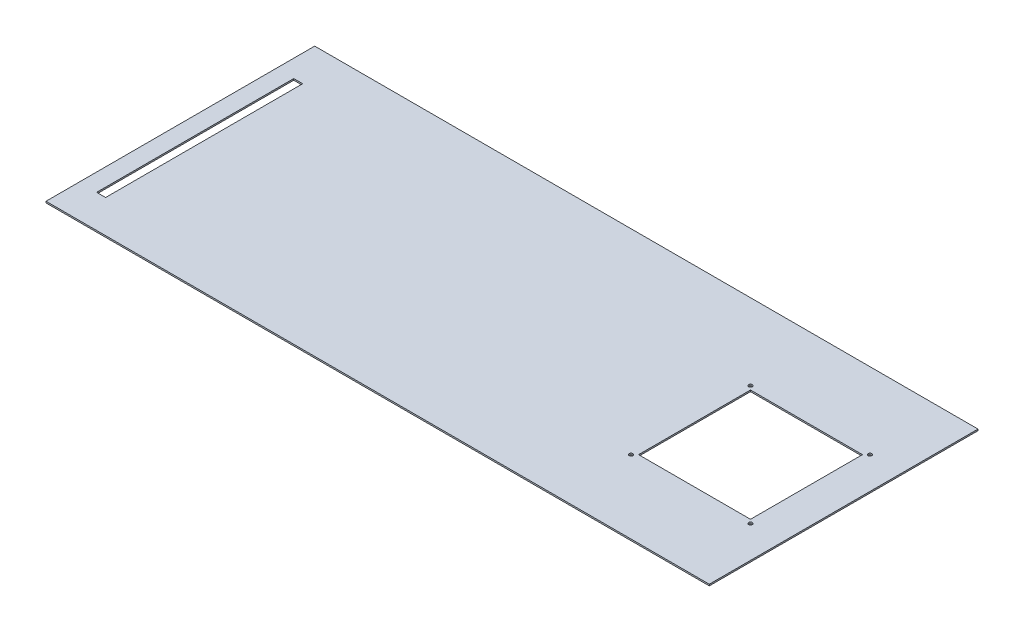
ISO-10303-21;
HEADER;
FILE_DESCRIPTION(('STEP AP214'),'2;1');
FILE_NAME('part.step','',(''),(''),'','','');
FILE_SCHEMA(('AUTOMOTIVE_DESIGN { 1 0 10303 214 1 1 1 1 }'));
ENDSEC;
DATA;
#1=APPLICATION_CONTEXT('core data for automotive mechanical design processes');
#2=APPLICATION_PROTOCOL_DEFINITION('international standard','automotive_design',2000,#1);
#3=PRODUCT_CONTEXT('',#1,'mechanical');
#4=PRODUCT('Part','Part','',(#3));
#5=PRODUCT_RELATED_PRODUCT_CATEGORY('part','',(#4));
#6=PRODUCT_DEFINITION_FORMATION('','',#4);
#7=PRODUCT_DEFINITION_CONTEXT('part definition',#1,'design');
#8=PRODUCT_DEFINITION('design','',#6,#7);
#9=PRODUCT_DEFINITION_SHAPE('','',#8);
#10=(LENGTH_UNIT() NAMED_UNIT(*) SI_UNIT(.MILLI.,.METRE.));
#11=(NAMED_UNIT(*) PLANE_ANGLE_UNIT() SI_UNIT($,.RADIAN.));
#12=(NAMED_UNIT(*) SI_UNIT($,.STERADIAN.) SOLID_ANGLE_UNIT());
#13=UNCERTAINTY_MEASURE_WITH_UNIT(LENGTH_MEASURE(1.E-05),#10,'distance_accuracy_value','');
#14=(GEOMETRIC_REPRESENTATION_CONTEXT(3) GLOBAL_UNCERTAINTY_ASSIGNED_CONTEXT((#13)) GLOBAL_UNIT_ASSIGNED_CONTEXT((#10,
#11,#12)) REPRESENTATION_CONTEXT('',''));
#15=CARTESIAN_POINT('',(0.,0.,0.));
#16=DIRECTION('',(0.,0.,1.));
#17=DIRECTION('',(1.,0.,0.));
#18=AXIS2_PLACEMENT_3D('',#15,#16,#17);
#19=CARTESIAN_POINT('',(-462.917777777778,2.,-190.916666666667));
#20=DIRECTION('',(1.,0.,0.));
#21=DIRECTION('',(0.,0.,-1.));
#22=AXIS2_PLACEMENT_3D('',#19,#20,#21);
#23=PLANE('',#22);
#24=DIRECTION('',(0.,0.,1.));
#25=VECTOR('',#24,1.);
#26=CARTESIAN_POINT('',(-462.917777777778,0.,-190.916666666667));
#27=LINE('',#26,#25);
#28=CARTESIAN_POINT('',(-462.917777777778,0.,-190.916666666667));
#29=VERTEX_POINT('',#28);
#30=CARTESIAN_POINT('',(-462.917777777778,0.,169.083333333333));
#31=VERTEX_POINT('',#30);
#32=EDGE_CURVE('E168',#29,#31,#27,.T.);
#33=ORIENTED_EDGE('',*,*,#32,.T.);
#34=DIRECTION('',(0.,-1.,0.));
#35=VECTOR('',#34,1.);
#36=CARTESIAN_POINT('',(-462.917777777778,2.,169.083333333333));
#37=LINE('',#36,#35);
#38=CARTESIAN_POINT('',(-462.917777777778,2.,169.083333333333));
#39=VERTEX_POINT('',#38);
#40=EDGE_CURVE('E201',#39,#31,#37,.T.);
#41=ORIENTED_EDGE('',*,*,#40,.F.);
#42=DIRECTION('',(0.,0.,1.));
#43=VECTOR('',#42,1.);
#44=CARTESIAN_POINT('',(-462.917777777778,2.,-190.916666666667));
#45=LINE('',#44,#43);
#46=CARTESIAN_POINT('',(-462.917777777778,2.,-190.916666666667));
#47=VERTEX_POINT('',#46);
#48=EDGE_CURVE('E175',#47,#39,#45,.T.);
#49=ORIENTED_EDGE('',*,*,#48,.F.);
#50=DIRECTION('',(0.,-1.,0.));
#51=VECTOR('',#50,1.);
#52=CARTESIAN_POINT('',(-462.917777777778,2.,-190.916666666667));
#53=LINE('',#52,#51);
#54=EDGE_CURVE('E185',#47,#29,#53,.T.);
#55=ORIENTED_EDGE('',*,*,#54,.T.);
#56=EDGE_LOOP('',(#33,#41,#49,#55));
#57=FACE_BOUND('',#56,.T.);
#58=ADVANCED_FACE('F35',(#57),#23,.F.);
#59=CARTESIAN_POINT('',(-462.917777777778,2.,169.083333333333));
#60=DIRECTION('',(0.,0.,-1.));
#61=DIRECTION('',(-1.,0.,0.));
#62=AXIS2_PLACEMENT_3D('',#59,#60,#61);
#63=PLANE('',#62);
#64=DIRECTION('',(1.,0.,0.));
#65=VECTOR('',#64,1.);
#66=CARTESIAN_POINT('',(-462.917777777778,0.,169.083333333333));
#67=LINE('',#66,#65);
#68=CARTESIAN_POINT('',(425.722222222222,0.,169.083333333333));
#69=VERTEX_POINT('',#68);
#70=EDGE_CURVE('E188',#31,#69,#67,.T.);
#71=ORIENTED_EDGE('',*,*,#70,.T.);
#72=DIRECTION('',(0.,-1.,0.));
#73=VECTOR('',#72,1.);
#74=CARTESIAN_POINT('',(425.722222222222,2.,169.083333333333));
#75=LINE('',#74,#73);
#76=CARTESIAN_POINT('',(425.722222222222,2.,169.083333333333));
#77=VERTEX_POINT('',#76);
#78=EDGE_CURVE('E198',#77,#69,#75,.T.);
#79=ORIENTED_EDGE('',*,*,#78,.F.);
#80=DIRECTION('',(1.,0.,0.));
#81=VECTOR('',#80,1.);
#82=CARTESIAN_POINT('',(-462.917777777778,2.,169.083333333333));
#83=LINE('',#82,#81);
#84=EDGE_CURVE('E178',#39,#77,#83,.T.);
#85=ORIENTED_EDGE('',*,*,#84,.F.);
#86=ORIENTED_EDGE('',*,*,#40,.T.);
#87=EDGE_LOOP('',(#71,#79,#85,#86));
#88=FACE_BOUND('',#87,.T.);
#89=ADVANCED_FACE('F248',(#88),#63,.F.);
#90=CARTESIAN_POINT('',(425.722222222222,2.,-190.916666666667));
#91=DIRECTION('',(-1.,0.,0.));
#92=DIRECTION('',(0.,0.,1.));
#93=AXIS2_PLACEMENT_3D('',#90,#91,#92);
#94=PLANE('',#93);
#95=DIRECTION('',(0.,0.,-1.));
#96=VECTOR('',#95,1.);
#97=CARTESIAN_POINT('',(425.722222222222,0.,-190.916666666667));
#98=LINE('',#97,#96);
#99=CARTESIAN_POINT('',(425.722222222222,0.,-190.916666666667));
#100=VERTEX_POINT('',#99);
#101=EDGE_CURVE('E190',#69,#100,#98,.T.);
#102=ORIENTED_EDGE('',*,*,#101,.T.);
#103=DIRECTION('',(0.,-1.,0.));
#104=VECTOR('',#103,1.);
#105=CARTESIAN_POINT('',(425.722222222222,2.,-190.916666666667));
#106=LINE('',#105,#104);
#107=CARTESIAN_POINT('',(425.722222222222,2.,-190.916666666667));
#108=VERTEX_POINT('',#107);
#109=EDGE_CURVE('E195',#108,#100,#106,.T.);
#110=ORIENTED_EDGE('',*,*,#109,.F.);
#111=DIRECTION('',(0.,0.,-1.));
#112=VECTOR('',#111,1.);
#113=CARTESIAN_POINT('',(425.722222222222,2.,-190.916666666667));
#114=LINE('',#113,#112);
#115=EDGE_CURVE('E181',#77,#108,#114,.T.);
#116=ORIENTED_EDGE('',*,*,#115,.F.);
#117=ORIENTED_EDGE('',*,*,#78,.T.);
#118=EDGE_LOOP('',(#102,#110,#116,#117));
#119=FACE_BOUND('',#118,.T.);
#120=ADVANCED_FACE('F253',(#119),#94,.F.);
#121=CARTESIAN_POINT('',(-462.917777777778,2.,-190.916666666667));
#122=DIRECTION('',(0.,0.,1.));
#123=DIRECTION('',(1.,0.,0.));
#124=AXIS2_PLACEMENT_3D('',#121,#122,#123);
#125=PLANE('',#124);
#126=DIRECTION('',(-1.,0.,0.));
#127=VECTOR('',#126,1.);
#128=CARTESIAN_POINT('',(-462.917777777778,0.,-190.916666666667));
#129=LINE('',#128,#127);
#130=EDGE_CURVE('E179',#100,#29,#129,.T.);
#131=ORIENTED_EDGE('',*,*,#130,.T.);
#132=ORIENTED_EDGE('',*,*,#54,.F.);
#133=DIRECTION('',(-1.,0.,0.));
#134=VECTOR('',#133,1.);
#135=CARTESIAN_POINT('',(-462.917777777778,2.,-190.916666666667));
#136=LINE('',#135,#134);
#137=EDGE_CURVE('E183',#108,#47,#136,.T.);
#138=ORIENTED_EDGE('',*,*,#137,.F.);
#139=ORIENTED_EDGE('',*,*,#109,.T.);
#140=EDGE_LOOP('',(#131,#132,#138,#139));
#141=FACE_BOUND('',#140,.T.);
#142=ADVANCED_FACE('F268',(#141),#125,.F.);
#143=CARTESIAN_POINT('',(0.,2.,0.));
#144=DIRECTION('',(0.,1.,0.));
#145=DIRECTION('',(0.,0.,1.));
#146=AXIS2_PLACEMENT_3D('',#143,#144,#145);
#147=PLANE('',#146);
#148=CARTESIAN_POINT('',(223.018484233851,2.,71.1612887754087));
#149=DIRECTION('',(0.,1.,0.));
#150=DIRECTION('',(0.,0.,-1.));
#151=AXIS2_PLACEMENT_3D('',#148,#149,#150);
#152=CIRCLE('',#151,2.5);
#153=CARTESIAN_POINT('',(223.018484233851,2.,68.6612887754087));
#154=VERTEX_POINT('',#153);
#155=EDGE_CURVE('E326',#154,#154,#152,.T.);
#156=ORIENTED_EDGE('',*,*,#155,.F.);
#157=EDGE_LOOP('',(#156));
#158=FACE_BOUND('',#157,.T.);
#159=CARTESIAN_POINT('',(383.018484233851,2.,71.1612887754087));
#160=DIRECTION('',(0.,1.,0.));
#161=DIRECTION('',(0.,0.,-1.));
#162=AXIS2_PLACEMENT_3D('',#159,#160,#161);
#163=CIRCLE('',#162,2.50000000000002);
#164=CARTESIAN_POINT('',(383.018484233851,2.,68.6612887754087));
#165=VERTEX_POINT('',#164);
#166=EDGE_CURVE('E328',#165,#165,#163,.T.);
#167=ORIENTED_EDGE('',*,*,#166,.F.);
#168=EDGE_LOOP('',(#167));
#169=FACE_BOUND('',#168,.T.);
#170=CARTESIAN_POINT('',(383.018484233851,2.,-88.8387112245913));
#171=DIRECTION('',(0.,1.,0.));
#172=DIRECTION('',(0.,0.,1.));
#173=AXIS2_PLACEMENT_3D('',#170,#171,#172);
#174=CIRCLE('',#173,2.50000000000002);
#175=CARTESIAN_POINT('',(383.018484233851,2.,-86.3387112245912));
#176=VERTEX_POINT('',#175);
#177=EDGE_CURVE('E323',#176,#176,#174,.T.);
#178=ORIENTED_EDGE('',*,*,#177,.F.);
#179=EDGE_LOOP('',(#178));
#180=FACE_BOUND('',#179,.T.);
#181=CARTESIAN_POINT('',(223.018484233851,2.,-88.8387112245913));
#182=DIRECTION('',(0.,1.,0.));
#183=DIRECTION('',(0.,0.,1.));
#184=AXIS2_PLACEMENT_3D('',#181,#182,#183);
#185=CIRCLE('',#184,2.5);
#186=CARTESIAN_POINT('',(223.018484233851,2.,-86.3387112245913));
#187=VERTEX_POINT('',#186);
#188=EDGE_CURVE('E321',#187,#187,#185,.T.);
#189=ORIENTED_EDGE('',*,*,#188,.F.);
#190=EDGE_LOOP('',(#189));
#191=FACE_BOUND('',#190,.T.);
#192=DIRECTION('',(0.,0.,1.));
#193=VECTOR('',#192,1.);
#194=CARTESIAN_POINT('',(228.018484233851,2.,-83.8387112245913));
#195=LINE('',#194,#193);
#196=CARTESIAN_POINT('',(228.018484233851,2.,-83.8387112245913));
#197=VERTEX_POINT('',#196);
#198=CARTESIAN_POINT('',(228.018484233851,2.,66.1612887754087));
#199=VERTEX_POINT('',#198);
#200=EDGE_CURVE('E51',#197,#199,#195,.T.);
#201=ORIENTED_EDGE('',*,*,#200,.F.);
#202=DIRECTION('',(-1.,0.,0.));
#203=VECTOR('',#202,1.);
#204=CARTESIAN_POINT('',(228.018484233851,2.,-83.8387112245913));
#205=LINE('',#204,#203);
#206=CARTESIAN_POINT('',(378.018484233851,2.,-83.8387112245913));
#207=VERTEX_POINT('',#206);
#208=EDGE_CURVE('E144',#207,#197,#205,.T.);
#209=ORIENTED_EDGE('',*,*,#208,.F.);
#210=DIRECTION('',(0.,0.,-1.));
#211=VECTOR('',#210,1.);
#212=CARTESIAN_POINT('',(378.018484233851,2.,-83.8387112245913));
#213=LINE('',#212,#211);
#214=CARTESIAN_POINT('',(378.018484233851,2.,66.1612887754087));
#215=VERTEX_POINT('',#214);
#216=EDGE_CURVE('E128',#215,#207,#213,.T.);
#217=ORIENTED_EDGE('',*,*,#216,.F.);
#218=DIRECTION('',(1.,0.,0.));
#219=VECTOR('',#218,1.);
#220=CARTESIAN_POINT('',(228.018484233851,2.,66.1612887754087));
#221=LINE('',#220,#219);
#222=EDGE_CURVE('E137',#199,#215,#221,.T.);
#223=ORIENTED_EDGE('',*,*,#222,.F.);
#224=EDGE_LOOP('',(#201,#209,#217,#223));
#225=FACE_BOUND('',#224,.T.);
#226=DIRECTION('',(0.,0.,1.));
#227=VECTOR('',#226,1.);
#228=CARTESIAN_POINT('',(-439.323058675668,2.,-139.201546042382));
#229=LINE('',#228,#227);
#230=CARTESIAN_POINT('',(-439.323058675668,2.,-139.201546042382));
#231=VERTEX_POINT('',#230);
#232=CARTESIAN_POINT('',(-439.323058675668,2.,124.836765433957));
#233=VERTEX_POINT('',#232);
#234=EDGE_CURVE('E154',#231,#233,#229,.T.);
#235=ORIENTED_EDGE('',*,*,#234,.F.);
#236=DIRECTION('',(-1.,0.,0.));
#237=VECTOR('',#236,1.);
#238=CARTESIAN_POINT('',(-439.323058675668,2.,-139.201546042382));
#239=LINE('',#238,#237);
#240=CARTESIAN_POINT('',(-427.323058675668,2.,-139.201546042382));
#241=VERTEX_POINT('',#240);
#242=EDGE_CURVE('E162',#241,#231,#239,.T.);
#243=ORIENTED_EDGE('',*,*,#242,.F.);
#244=DIRECTION('',(0.,0.,-1.));
#245=VECTOR('',#244,1.);
#246=CARTESIAN_POINT('',(-427.323058675668,2.,-139.201546042382));
#247=LINE('',#246,#245);
#248=CARTESIAN_POINT('',(-427.323058675668,2.,124.836765433957));
#249=VERTEX_POINT('',#248);
#250=EDGE_CURVE('E159',#249,#241,#247,.T.);
#251=ORIENTED_EDGE('',*,*,#250,.F.);
#252=DIRECTION('',(1.,0.,0.));
#253=VECTOR('',#252,1.);
#254=CARTESIAN_POINT('',(-439.323058675668,2.,124.836765433957));
#255=LINE('',#254,#253);
#256=EDGE_CURVE('E156',#233,#249,#255,.T.);
#257=ORIENTED_EDGE('',*,*,#256,.F.);
#258=EDGE_LOOP('',(#235,#243,#251,#257));
#259=FACE_BOUND('',#258,.T.);
#260=ORIENTED_EDGE('',*,*,#48,.T.);
#261=ORIENTED_EDGE('',*,*,#84,.T.);
#262=ORIENTED_EDGE('',*,*,#115,.T.);
#263=ORIENTED_EDGE('',*,*,#137,.T.);
#264=EDGE_LOOP('',(#260,#261,#262,#263));
#265=FACE_BOUND('',#264,.T.);
#266=ADVANCED_FACE('F141',(#158,#169,#180,#191,#225,#259,#265),#147,.T.);
#267=CARTESIAN_POINT('',(0.,0.,0.));
#268=DIRECTION('',(0.,1.,0.));
#269=DIRECTION('',(0.,0.,1.));
#270=AXIS2_PLACEMENT_3D('',#267,#268,#269);
#271=PLANE('',#270);
#272=CARTESIAN_POINT('',(223.018484233851,0.,71.1612887754087));
#273=DIRECTION('',(0.,1.,0.));
#274=DIRECTION('',(0.,0.,1.));
#275=AXIS2_PLACEMENT_3D('',#272,#273,#274);
#276=CIRCLE('',#275,2.5);
#277=CARTESIAN_POINT('',(223.018484233851,0.,73.6612887754087));
#278=VERTEX_POINT('',#277);
#279=EDGE_CURVE('E38',#278,#278,#276,.T.);
#280=ORIENTED_EDGE('',*,*,#279,.T.);
#281=EDGE_LOOP('',(#280));
#282=FACE_BOUND('',#281,.T.);
#283=CARTESIAN_POINT('',(383.018484233851,0.,71.1612887754087));
#284=DIRECTION('',(0.,1.,0.));
#285=DIRECTION('',(0.,0.,1.));
#286=AXIS2_PLACEMENT_3D('',#283,#284,#285);
#287=CIRCLE('',#286,2.50000000000002);
#288=CARTESIAN_POINT('',(383.018484233851,0.,73.6612887754088));
#289=VERTEX_POINT('',#288);
#290=EDGE_CURVE('E225',#289,#289,#287,.T.);
#291=ORIENTED_EDGE('',*,*,#290,.T.);
#292=EDGE_LOOP('',(#291));
#293=FACE_BOUND('',#292,.T.);
#294=CARTESIAN_POINT('',(383.018484233851,0.,-88.8387112245913));
#295=DIRECTION('',(0.,1.,0.));
#296=DIRECTION('',(0.,0.,1.));
#297=AXIS2_PLACEMENT_3D('',#294,#295,#296);
#298=CIRCLE('',#297,2.50000000000002);
#299=CARTESIAN_POINT('',(383.018484233851,0.,-86.3387112245912));
#300=VERTEX_POINT('',#299);
#301=EDGE_CURVE('E223',#300,#300,#298,.T.);
#302=ORIENTED_EDGE('',*,*,#301,.T.);
#303=EDGE_LOOP('',(#302));
#304=FACE_BOUND('',#303,.T.);
#305=CARTESIAN_POINT('',(223.018484233851,0.,-88.8387112245913));
#306=DIRECTION('',(0.,1.,0.));
#307=DIRECTION('',(0.,0.,1.));
#308=AXIS2_PLACEMENT_3D('',#305,#306,#307);
#309=CIRCLE('',#308,2.5);
#310=CARTESIAN_POINT('',(223.018484233851,0.,-86.3387112245913));
#311=VERTEX_POINT('',#310);
#312=EDGE_CURVE('E151',#311,#311,#309,.T.);
#313=ORIENTED_EDGE('',*,*,#312,.T.);
#314=EDGE_LOOP('',(#313));
#315=FACE_BOUND('',#314,.T.);
#316=DIRECTION('',(-1.,0.,0.));
#317=VECTOR('',#316,1.);
#318=CARTESIAN_POINT('',(0.,0.,-83.8387112245913));
#319=LINE('',#318,#317);
#320=CARTESIAN_POINT('',(378.018484233851,0.,-83.8387112245913));
#321=VERTEX_POINT('',#320);
#322=CARTESIAN_POINT('',(228.018484233851,0.,-83.8387112245913));
#323=VERTEX_POINT('',#322);
#324=EDGE_CURVE('E43',#321,#323,#319,.T.);
#325=ORIENTED_EDGE('',*,*,#324,.T.);
#326=DIRECTION('',(0.,0.,1.));
#327=VECTOR('',#326,1.);
#328=CARTESIAN_POINT('',(228.018484233851,0.,0.));
#329=LINE('',#328,#327);
#330=CARTESIAN_POINT('',(228.018484233851,0.,66.1612887754087));
#331=VERTEX_POINT('',#330);
#332=EDGE_CURVE('E11',#323,#331,#329,.T.);
#333=ORIENTED_EDGE('',*,*,#332,.T.);
#334=DIRECTION('',(1.,0.,0.));
#335=VECTOR('',#334,1.);
#336=CARTESIAN_POINT('',(0.,0.,66.1612887754087));
#337=LINE('',#336,#335);
#338=CARTESIAN_POINT('',(378.018484233851,0.,66.1612887754087));
#339=VERTEX_POINT('',#338);
#340=EDGE_CURVE('E216',#331,#339,#337,.T.);
#341=ORIENTED_EDGE('',*,*,#340,.T.);
#342=DIRECTION('',(0.,0.,-1.));
#343=VECTOR('',#342,1.);
#344=CARTESIAN_POINT('',(378.018484233851,0.,0.));
#345=LINE('',#344,#343);
#346=EDGE_CURVE('E131',#339,#321,#345,.T.);
#347=ORIENTED_EDGE('',*,*,#346,.T.);
#348=EDGE_LOOP('',(#325,#333,#341,#347));
#349=FACE_BOUND('',#348,.T.);
#350=DIRECTION('',(-1.,0.,0.));
#351=VECTOR('',#350,1.);
#352=CARTESIAN_POINT('',(0.,0.,-139.201546042382));
#353=LINE('',#352,#351);
#354=CARTESIAN_POINT('',(-427.323058675668,0.,-139.201546042382));
#355=VERTEX_POINT('',#354);
#356=CARTESIAN_POINT('',(-439.323058675668,0.,-139.201546042382));
#357=VERTEX_POINT('',#356);
#358=EDGE_CURVE('E210',#355,#357,#353,.T.);
#359=ORIENTED_EDGE('',*,*,#358,.T.);
#360=DIRECTION('',(0.,0.,1.));
#361=VECTOR('',#360,1.);
#362=CARTESIAN_POINT('',(-439.323058675668,0.,0.));
#363=LINE('',#362,#361);
#364=CARTESIAN_POINT('',(-439.323058675668,0.,124.836765433957));
#365=VERTEX_POINT('',#364);
#366=EDGE_CURVE('E213',#357,#365,#363,.T.);
#367=ORIENTED_EDGE('',*,*,#366,.T.);
#368=DIRECTION('',(1.,0.,0.));
#369=VECTOR('',#368,1.);
#370=CARTESIAN_POINT('',(1.4437151177553E-13,0.,124.836765433957));
#371=LINE('',#370,#369);
#372=CARTESIAN_POINT('',(-427.323058675668,0.,124.836765433957));
#373=VERTEX_POINT('',#372);
#374=EDGE_CURVE('E204',#365,#373,#371,.T.);
#375=ORIENTED_EDGE('',*,*,#374,.T.);
#376=DIRECTION('',(0.,0.,-1.));
#377=VECTOR('',#376,1.);
#378=CARTESIAN_POINT('',(-427.323058675668,0.,0.));
#379=LINE('',#378,#377);
#380=EDGE_CURVE('E207',#373,#355,#379,.T.);
#381=ORIENTED_EDGE('',*,*,#380,.T.);
#382=EDGE_LOOP('',(#359,#367,#375,#381));
#383=FACE_BOUND('',#382,.T.);
#384=ORIENTED_EDGE('',*,*,#32,.F.);
#385=ORIENTED_EDGE('',*,*,#130,.F.);
#386=ORIENTED_EDGE('',*,*,#101,.F.);
#387=ORIENTED_EDGE('',*,*,#70,.F.);
#388=EDGE_LOOP('',(#384,#385,#386,#387));
#389=FACE_BOUND('',#388,.T.);
#390=ADVANCED_FACE('F232',(#282,#293,#304,#315,#349,#383,#389),#271,.F.);
#391=CARTESIAN_POINT('',(-439.323058675668,-8.,-139.201546042382));
#392=DIRECTION('',(-1.,0.,0.));
#393=DIRECTION('',(0.,0.,1.));
#394=AXIS2_PLACEMENT_3D('',#391,#392,#393);
#395=PLANE('',#394);
#396=DIRECTION('',(0.,1.,0.));
#397=VECTOR('',#396,1.);
#398=CARTESIAN_POINT('',(-439.323058675668,-8.,-139.201546042382));
#399=LINE('',#398,#397);
#400=EDGE_CURVE('E166',#357,#231,#399,.T.);
#401=ORIENTED_EDGE('',*,*,#400,.T.);
#402=ORIENTED_EDGE('',*,*,#234,.T.);
#403=DIRECTION('',(0.,1.,0.));
#404=VECTOR('',#403,1.);
#405=CARTESIAN_POINT('',(-439.323058675668,-8.,124.836765433957));
#406=LINE('',#405,#404);
#407=EDGE_CURVE('E165',#365,#233,#406,.T.);
#408=ORIENTED_EDGE('',*,*,#407,.F.);
#409=ORIENTED_EDGE('',*,*,#366,.F.);
#410=EDGE_LOOP('',(#401,#402,#408,#409));
#411=FACE_BOUND('',#410,.T.);
#412=ADVANCED_FACE('F279',(#411),#395,.F.);
#413=CARTESIAN_POINT('',(-439.323058675668,-8.,-139.201546042382));
#414=DIRECTION('',(0.,0.,-1.));
#415=DIRECTION('',(-1.,0.,0.));
#416=AXIS2_PLACEMENT_3D('',#413,#414,#415);
#417=PLANE('',#416);
#418=DIRECTION('',(0.,1.,0.));
#419=VECTOR('',#418,1.);
#420=CARTESIAN_POINT('',(-427.323058675668,-8.,-139.201546042382));
#421=LINE('',#420,#419);
#422=EDGE_CURVE('E169',#355,#241,#421,.T.);
#423=ORIENTED_EDGE('',*,*,#422,.T.);
#424=ORIENTED_EDGE('',*,*,#242,.T.);
#425=ORIENTED_EDGE('',*,*,#400,.F.);
#426=ORIENTED_EDGE('',*,*,#358,.F.);
#427=EDGE_LOOP('',(#423,#424,#425,#426));
#428=FACE_BOUND('',#427,.T.);
#429=ADVANCED_FACE('F285',(#428),#417,.F.);
#430=CARTESIAN_POINT('',(-427.323058675668,-8.,-139.201546042382));
#431=DIRECTION('',(1.,0.,0.));
#432=DIRECTION('',(0.,0.,-1.));
#433=AXIS2_PLACEMENT_3D('',#430,#431,#432);
#434=PLANE('',#433);
#435=DIRECTION('',(0.,1.,0.));
#436=VECTOR('',#435,1.);
#437=CARTESIAN_POINT('',(-427.323058675668,-8.,124.836765433957));
#438=LINE('',#437,#436);
#439=EDGE_CURVE('E171',#373,#249,#438,.T.);
#440=ORIENTED_EDGE('',*,*,#439,.T.);
#441=ORIENTED_EDGE('',*,*,#250,.T.);
#442=ORIENTED_EDGE('',*,*,#422,.F.);
#443=ORIENTED_EDGE('',*,*,#380,.F.);
#444=EDGE_LOOP('',(#440,#441,#442,#443));
#445=FACE_BOUND('',#444,.T.);
#446=ADVANCED_FACE('F291',(#445),#434,.F.);
#447=CARTESIAN_POINT('',(-439.323058675668,-8.,124.836765433957));
#448=DIRECTION('',(0.,0.,1.));
#449=DIRECTION('',(1.,0.,0.));
#450=AXIS2_PLACEMENT_3D('',#447,#448,#449);
#451=PLANE('',#450);
#452=ORIENTED_EDGE('',*,*,#407,.T.);
#453=ORIENTED_EDGE('',*,*,#256,.T.);
#454=ORIENTED_EDGE('',*,*,#439,.F.);
#455=ORIENTED_EDGE('',*,*,#374,.F.);
#456=EDGE_LOOP('',(#452,#453,#454,#455));
#457=FACE_BOUND('',#456,.T.);
#458=ADVANCED_FACE('F287',(#457),#451,.F.);
#459=CARTESIAN_POINT('',(228.018484233851,-8.,-83.8387112245913));
#460=DIRECTION('',(-1.,0.,0.));
#461=DIRECTION('',(0.,0.,1.));
#462=AXIS2_PLACEMENT_3D('',#459,#460,#461);
#463=PLANE('',#462);
#464=DIRECTION('',(0.,1.,0.));
#465=VECTOR('',#464,1.);
#466=CARTESIAN_POINT('',(228.018484233851,-8.,-83.8387112245913));
#467=LINE('',#466,#465);
#468=EDGE_CURVE('E149',#323,#197,#467,.T.);
#469=ORIENTED_EDGE('',*,*,#468,.T.);
#470=ORIENTED_EDGE('',*,*,#200,.T.);
#471=DIRECTION('',(0.,1.,0.));
#472=VECTOR('',#471,1.);
#473=CARTESIAN_POINT('',(228.018484233851,-8.,66.1612887754087));
#474=LINE('',#473,#472);
#475=EDGE_CURVE('E134',#331,#199,#474,.T.);
#476=ORIENTED_EDGE('',*,*,#475,.F.);
#477=ORIENTED_EDGE('',*,*,#332,.F.);
#478=EDGE_LOOP('',(#469,#470,#476,#477));
#479=FACE_BOUND('',#478,.T.);
#480=ADVANCED_FACE('F290',(#479),#463,.F.);
#481=CARTESIAN_POINT('',(228.018484233851,-8.,-83.8387112245913));
#482=DIRECTION('',(0.,0.,-1.));
#483=DIRECTION('',(-1.,0.,0.));
#484=AXIS2_PLACEMENT_3D('',#481,#482,#483);
#485=PLANE('',#484);
#486=DIRECTION('',(0.,1.,0.));
#487=VECTOR('',#486,1.);
#488=CARTESIAN_POINT('',(378.018484233851,-8.,-83.8387112245913));
#489=LINE('',#488,#487);
#490=EDGE_CURVE('E133',#321,#207,#489,.T.);
#491=ORIENTED_EDGE('',*,*,#490,.T.);
#492=ORIENTED_EDGE('',*,*,#208,.T.);
#493=ORIENTED_EDGE('',*,*,#468,.F.);
#494=ORIENTED_EDGE('',*,*,#324,.F.);
#495=EDGE_LOOP('',(#491,#492,#493,#494));
#496=FACE_BOUND('',#495,.T.);
#497=ADVANCED_FACE('F301',(#496),#485,.F.);
#498=CARTESIAN_POINT('',(378.018484233851,-8.,-83.8387112245913));
#499=DIRECTION('',(1.,0.,0.));
#500=DIRECTION('',(0.,0.,-1.));
#501=AXIS2_PLACEMENT_3D('',#498,#499,#500);
#502=PLANE('',#501);
#503=DIRECTION('',(0.,1.,0.));
#504=VECTOR('',#503,1.);
#505=CARTESIAN_POINT('',(378.018484233851,-8.,66.1612887754087));
#506=LINE('',#505,#504);
#507=EDGE_CURVE('E59',#339,#215,#506,.T.);
#508=ORIENTED_EDGE('',*,*,#507,.T.);
#509=ORIENTED_EDGE('',*,*,#216,.T.);
#510=ORIENTED_EDGE('',*,*,#490,.F.);
#511=ORIENTED_EDGE('',*,*,#346,.F.);
#512=EDGE_LOOP('',(#508,#509,#510,#511));
#513=FACE_BOUND('',#512,.T.);
#514=ADVANCED_FACE('F125',(#513),#502,.F.);
#515=CARTESIAN_POINT('',(228.018484233851,-8.,66.1612887754087));
#516=DIRECTION('',(0.,0.,1.));
#517=DIRECTION('',(1.,0.,0.));
#518=AXIS2_PLACEMENT_3D('',#515,#516,#517);
#519=PLANE('',#518);
#520=ORIENTED_EDGE('',*,*,#475,.T.);
#521=ORIENTED_EDGE('',*,*,#222,.T.);
#522=ORIENTED_EDGE('',*,*,#507,.F.);
#523=ORIENTED_EDGE('',*,*,#340,.F.);
#524=EDGE_LOOP('',(#520,#521,#522,#523));
#525=FACE_BOUND('',#524,.T.);
#526=ADVANCED_FACE('F138',(#525),#519,.F.);
#527=CARTESIAN_POINT('',(223.018484233851,-8.,-88.8387112245913));
#528=DIRECTION('',(0.,1.,0.));
#529=DIRECTION('',(0.,0.,1.));
#530=AXIS2_PLACEMENT_3D('',#527,#528,#529);
#531=CYLINDRICAL_SURFACE('',#530,2.5);
#532=ORIENTED_EDGE('',*,*,#188,.T.);
#533=EDGE_LOOP('',(#532));
#534=FACE_BOUND('',#533,.T.);
#535=ORIENTED_EDGE('',*,*,#312,.F.);
#536=EDGE_LOOP('',(#535));
#537=FACE_BOUND('',#536,.T.);
#538=ADVANCED_FACE('F304',(#534,#537),#531,.F.);
#539=CARTESIAN_POINT('',(383.018484233851,-8.,-88.8387112245913));
#540=DIRECTION('',(0.,1.,0.));
#541=DIRECTION('',(0.,0.,1.));
#542=AXIS2_PLACEMENT_3D('',#539,#540,#541);
#543=CYLINDRICAL_SURFACE('',#542,2.50000000000002);
#544=ORIENTED_EDGE('',*,*,#177,.T.);
#545=EDGE_LOOP('',(#544));
#546=FACE_BOUND('',#545,.T.);
#547=ORIENTED_EDGE('',*,*,#301,.F.);
#548=EDGE_LOOP('',(#547));
#549=FACE_BOUND('',#548,.T.);
#550=ADVANCED_FACE('F242',(#546,#549),#543,.F.);
#551=CARTESIAN_POINT('',(383.018484233851,-8.,71.1612887754087));
#552=DIRECTION('',(0.,1.,0.));
#553=DIRECTION('',(0.,0.,1.));
#554=AXIS2_PLACEMENT_3D('',#551,#552,#553);
#555=CYLINDRICAL_SURFACE('',#554,2.50000000000002);
#556=ORIENTED_EDGE('',*,*,#166,.T.);
#557=EDGE_LOOP('',(#556));
#558=FACE_BOUND('',#557,.T.);
#559=ORIENTED_EDGE('',*,*,#290,.F.);
#560=EDGE_LOOP('',(#559));
#561=FACE_BOUND('',#560,.T.);
#562=ADVANCED_FACE('F236',(#558,#561),#555,.F.);
#563=CARTESIAN_POINT('',(223.018484233851,-8.,71.1612887754087));
#564=DIRECTION('',(0.,1.,0.));
#565=DIRECTION('',(0.,0.,1.));
#566=AXIS2_PLACEMENT_3D('',#563,#564,#565);
#567=CYLINDRICAL_SURFACE('',#566,2.5);
#568=ORIENTED_EDGE('',*,*,#155,.T.);
#569=EDGE_LOOP('',(#568));
#570=FACE_BOUND('',#569,.T.);
#571=ORIENTED_EDGE('',*,*,#279,.F.);
#572=EDGE_LOOP('',(#571));
#573=FACE_BOUND('',#572,.T.);
#574=ADVANCED_FACE('F234',(#570,#573),#567,.F.);
#575=CLOSED_SHELL('',(#58,#89,#120,#142,#266,#390,#412,#429,#446,#458,#480,#497,#514,#526,#538,
#550,#562,#574));
#576=MANIFOLD_SOLID_BREP('B2',#575);
#577=ADVANCED_BREP_SHAPE_REPRESENTATION('',(#18,#576),#14);
#578=SHAPE_DEFINITION_REPRESENTATION(#9,#577);
ENDSEC;
END-ISO-10303-21;
